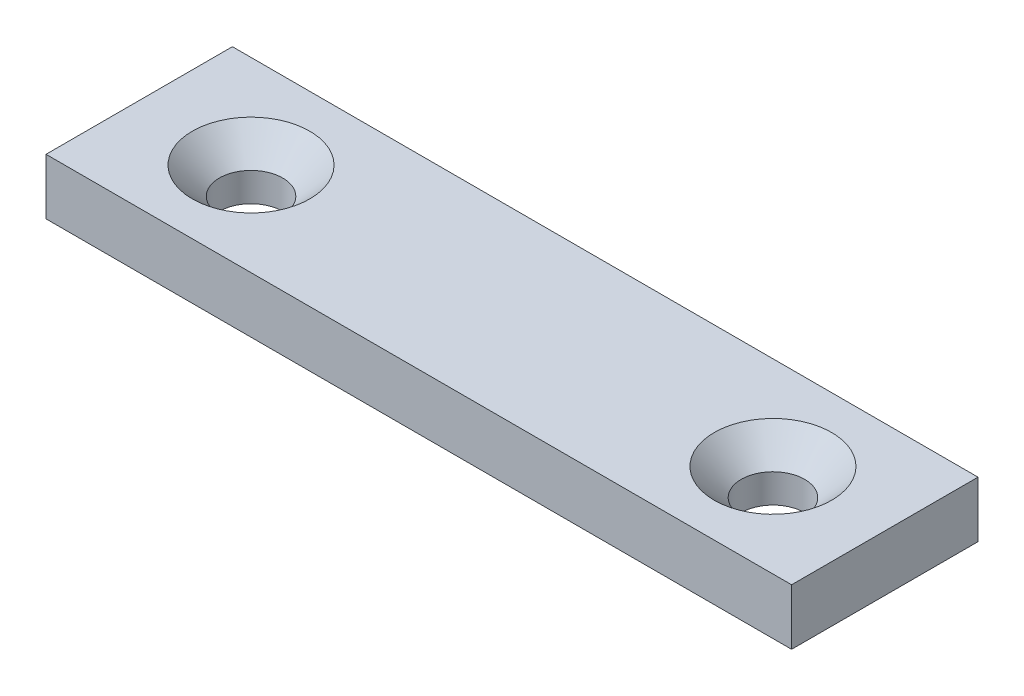
ISO-10303-21;
HEADER;
FILE_DESCRIPTION(('STEP AP214'),'2;1');
FILE_NAME('part.step','',(''),(''),'','','');
FILE_SCHEMA(('AUTOMOTIVE_DESIGN { 1 0 10303 214 1 1 1 1 }'));
ENDSEC;
DATA;
#1=APPLICATION_CONTEXT('core data for automotive mechanical design processes');
#2=APPLICATION_PROTOCOL_DEFINITION('international standard','automotive_design',2000,#1);
#3=PRODUCT_CONTEXT('',#1,'mechanical');
#4=PRODUCT('Part','Part','',(#3));
#5=PRODUCT_RELATED_PRODUCT_CATEGORY('part','',(#4));
#6=PRODUCT_DEFINITION_FORMATION('','',#4);
#7=PRODUCT_DEFINITION_CONTEXT('part definition',#1,'design');
#8=PRODUCT_DEFINITION('design','',#6,#7);
#9=PRODUCT_DEFINITION_SHAPE('','',#8);
#10=(LENGTH_UNIT() NAMED_UNIT(*) SI_UNIT(.MILLI.,.METRE.));
#11=(NAMED_UNIT(*) PLANE_ANGLE_UNIT() SI_UNIT($,.RADIAN.));
#12=(NAMED_UNIT(*) SI_UNIT($,.STERADIAN.) SOLID_ANGLE_UNIT());
#13=UNCERTAINTY_MEASURE_WITH_UNIT(LENGTH_MEASURE(1.E-05),#10,'distance_accuracy_value','');
#14=(GEOMETRIC_REPRESENTATION_CONTEXT(3) GLOBAL_UNCERTAINTY_ASSIGNED_CONTEXT((#13)) GLOBAL_UNIT_ASSIGNED_CONTEXT((#10,
#11,#12)) REPRESENTATION_CONTEXT('',''));
#15=CARTESIAN_POINT('',(0.,0.,0.));
#16=DIRECTION('',(0.,0.,1.));
#17=DIRECTION('',(1.,0.,0.));
#18=AXIS2_PLACEMENT_3D('',#15,#16,#17);
#19=CARTESIAN_POINT('',(20.,3.,5.));
#20=DIRECTION('',(-1.,0.,0.));
#21=DIRECTION('',(0.,0.,1.));
#22=AXIS2_PLACEMENT_3D('',#19,#20,#21);
#23=PLANE('',#22);
#24=DIRECTION('',(0.,0.,-1.));
#25=VECTOR('',#24,1.);
#26=CARTESIAN_POINT('',(20.,0.,5.));
#27=LINE('',#26,#25);
#28=CARTESIAN_POINT('',(20.,0.,5.));
#29=VERTEX_POINT('',#28);
#30=CARTESIAN_POINT('',(20.,0.,-5.));
#31=VERTEX_POINT('',#30);
#32=EDGE_CURVE('E97',#29,#31,#27,.T.);
#33=ORIENTED_EDGE('',*,*,#32,.T.);
#34=DIRECTION('',(0.,-1.,0.));
#35=VECTOR('',#34,1.);
#36=CARTESIAN_POINT('',(20.,3.,-5.));
#37=LINE('',#36,#35);
#38=CARTESIAN_POINT('',(20.,3.,-5.));
#39=VERTEX_POINT('',#38);
#40=EDGE_CURVE('E11',#39,#31,#37,.T.);
#41=ORIENTED_EDGE('',*,*,#40,.F.);
#42=DIRECTION('',(0.,0.,-1.));
#43=VECTOR('',#42,1.);
#44=CARTESIAN_POINT('',(20.,3.,5.));
#45=LINE('',#44,#43);
#46=CARTESIAN_POINT('',(20.,3.,5.));
#47=VERTEX_POINT('',#46);
#48=EDGE_CURVE('E85',#47,#39,#45,.T.);
#49=ORIENTED_EDGE('',*,*,#48,.F.);
#50=DIRECTION('',(0.,-1.,0.));
#51=VECTOR('',#50,1.);
#52=CARTESIAN_POINT('',(20.,3.,5.));
#53=LINE('',#52,#51);
#54=EDGE_CURVE('E93',#47,#29,#53,.T.);
#55=ORIENTED_EDGE('',*,*,#54,.T.);
#56=EDGE_LOOP('',(#33,#41,#49,#55));
#57=FACE_BOUND('',#56,.T.);
#58=ADVANCED_FACE('F34',(#57),#23,.F.);
#59=CARTESIAN_POINT('',(-20.,3.,-5.));
#60=DIRECTION('',(0.,0.,1.));
#61=DIRECTION('',(1.,0.,0.));
#62=AXIS2_PLACEMENT_3D('',#59,#60,#61);
#63=PLANE('',#62);
#64=DIRECTION('',(-1.,0.,0.));
#65=VECTOR('',#64,1.);
#66=CARTESIAN_POINT('',(-20.,0.,-5.));
#67=LINE('',#66,#65);
#68=CARTESIAN_POINT('',(-20.,0.,-5.));
#69=VERTEX_POINT('',#68);
#70=EDGE_CURVE('E89',#31,#69,#67,.T.);
#71=ORIENTED_EDGE('',*,*,#70,.T.);
#72=DIRECTION('',(0.,-1.,0.));
#73=VECTOR('',#72,1.);
#74=CARTESIAN_POINT('',(-20.,3.,-5.));
#75=LINE('',#74,#73);
#76=CARTESIAN_POINT('',(-20.,3.,-5.));
#77=VERTEX_POINT('',#76);
#78=EDGE_CURVE('E42',#77,#69,#75,.T.);
#79=ORIENTED_EDGE('',*,*,#78,.F.);
#80=DIRECTION('',(-1.,0.,0.));
#81=VECTOR('',#80,1.);
#82=CARTESIAN_POINT('',(-20.,3.,-5.));
#83=LINE('',#82,#81);
#84=EDGE_CURVE('E80',#39,#77,#83,.T.);
#85=ORIENTED_EDGE('',*,*,#84,.F.);
#86=ORIENTED_EDGE('',*,*,#40,.T.);
#87=EDGE_LOOP('',(#71,#79,#85,#86));
#88=FACE_BOUND('',#87,.T.);
#89=ADVANCED_FACE('F88',(#88),#63,.F.);
#90=CARTESIAN_POINT('',(-20.,3.,5.));
#91=DIRECTION('',(1.,0.,0.));
#92=DIRECTION('',(0.,0.,-1.));
#93=AXIS2_PLACEMENT_3D('',#90,#91,#92);
#94=PLANE('',#93);
#95=DIRECTION('',(0.,0.,1.));
#96=VECTOR('',#95,1.);
#97=CARTESIAN_POINT('',(-20.,0.,5.));
#98=LINE('',#97,#96);
#99=CARTESIAN_POINT('',(-20.,0.,5.));
#100=VERTEX_POINT('',#99);
#101=EDGE_CURVE('E67',#69,#100,#98,.T.);
#102=ORIENTED_EDGE('',*,*,#101,.T.);
#103=DIRECTION('',(0.,-1.,0.));
#104=VECTOR('',#103,1.);
#105=CARTESIAN_POINT('',(-20.,3.,5.));
#106=LINE('',#105,#104);
#107=CARTESIAN_POINT('',(-20.,3.,5.));
#108=VERTEX_POINT('',#107);
#109=EDGE_CURVE('E90',#108,#100,#106,.T.);
#110=ORIENTED_EDGE('',*,*,#109,.F.);
#111=DIRECTION('',(0.,0.,1.));
#112=VECTOR('',#111,1.);
#113=CARTESIAN_POINT('',(-20.,3.,5.));
#114=LINE('',#113,#112);
#115=EDGE_CURVE('E83',#77,#108,#114,.T.);
#116=ORIENTED_EDGE('',*,*,#115,.F.);
#117=ORIENTED_EDGE('',*,*,#78,.T.);
#118=EDGE_LOOP('',(#102,#110,#116,#117));
#119=FACE_BOUND('',#118,.T.);
#120=ADVANCED_FACE('F91',(#119),#94,.F.);
#121=CARTESIAN_POINT('',(-20.,3.,5.));
#122=DIRECTION('',(0.,0.,-1.));
#123=DIRECTION('',(-1.,0.,0.));
#124=AXIS2_PLACEMENT_3D('',#121,#122,#123);
#125=PLANE('',#124);
#126=DIRECTION('',(1.,0.,0.));
#127=VECTOR('',#126,1.);
#128=CARTESIAN_POINT('',(-20.,0.,5.));
#129=LINE('',#128,#127);
#130=EDGE_CURVE('E73',#100,#29,#129,.T.);
#131=ORIENTED_EDGE('',*,*,#130,.T.);
#132=ORIENTED_EDGE('',*,*,#54,.F.);
#133=DIRECTION('',(1.,0.,0.));
#134=VECTOR('',#133,1.);
#135=CARTESIAN_POINT('',(-20.,3.,5.));
#136=LINE('',#135,#134);
#137=EDGE_CURVE('E50',#108,#47,#136,.T.);
#138=ORIENTED_EDGE('',*,*,#137,.F.);
#139=ORIENTED_EDGE('',*,*,#109,.T.);
#140=EDGE_LOOP('',(#131,#132,#138,#139));
#141=FACE_BOUND('',#140,.T.);
#142=ADVANCED_FACE('F105',(#141),#125,.F.);
#143=CARTESIAN_POINT('',(0.,3.,0.));
#144=DIRECTION('',(0.,-1.,0.));
#145=DIRECTION('',(0.,0.,-1.));
#146=AXIS2_PLACEMENT_3D('',#143,#144,#145);
#147=PLANE('',#146);
#148=CARTESIAN_POINT('',(-14.,3.,0.));
#149=DIRECTION('',(0.,1.,0.));
#150=DIRECTION('',(0.,0.,1.));
#151=AXIS2_PLACEMENT_3D('',#148,#149,#150);
#152=CIRCLE('',#151,3.15);
#153=CARTESIAN_POINT('',(-14.,3.,3.15));
#154=VERTEX_POINT('',#153);
#155=EDGE_CURVE('E125',#154,#154,#152,.T.);
#156=ORIENTED_EDGE('',*,*,#155,.F.);
#157=EDGE_LOOP('',(#156));
#158=FACE_BOUND('',#157,.T.);
#159=CARTESIAN_POINT('',(14.,3.,0.));
#160=DIRECTION('',(0.,1.,0.));
#161=DIRECTION('',(0.,0.,1.));
#162=AXIS2_PLACEMENT_3D('',#159,#160,#161);
#163=CIRCLE('',#162,3.15);
#164=CARTESIAN_POINT('',(14.,3.,3.14999999999999));
#165=VERTEX_POINT('',#164);
#166=EDGE_CURVE('E116',#165,#165,#163,.T.);
#167=ORIENTED_EDGE('',*,*,#166,.F.);
#168=EDGE_LOOP('',(#167));
#169=FACE_BOUND('',#168,.T.);
#170=ORIENTED_EDGE('',*,*,#48,.T.);
#171=ORIENTED_EDGE('',*,*,#84,.T.);
#172=ORIENTED_EDGE('',*,*,#115,.T.);
#173=ORIENTED_EDGE('',*,*,#137,.T.);
#174=EDGE_LOOP('',(#170,#171,#172,#173));
#175=FACE_BOUND('',#174,.T.);
#176=ADVANCED_FACE('F81',(#158,#169,#175),#147,.F.);
#177=CARTESIAN_POINT('',(0.,0.,0.));
#178=DIRECTION('',(0.,-1.,0.));
#179=DIRECTION('',(0.,0.,-1.));
#180=AXIS2_PLACEMENT_3D('',#177,#178,#179);
#181=PLANE('',#180);
#182=CARTESIAN_POINT('',(-14.,0.,0.));
#183=DIRECTION('',(0.,1.,0.));
#184=DIRECTION('',(0.,0.,1.));
#185=AXIS2_PLACEMENT_3D('',#182,#183,#184);
#186=CIRCLE('',#185,1.7);
#187=CARTESIAN_POINT('',(-14.,0.,1.7));
#188=VERTEX_POINT('',#187);
#189=EDGE_CURVE('E119',#188,#188,#186,.T.);
#190=ORIENTED_EDGE('',*,*,#189,.T.);
#191=EDGE_LOOP('',(#190));
#192=FACE_BOUND('',#191,.T.);
#193=CARTESIAN_POINT('',(14.,0.,0.));
#194=DIRECTION('',(0.,1.,0.));
#195=DIRECTION('',(0.,0.,1.));
#196=AXIS2_PLACEMENT_3D('',#193,#194,#195);
#197=CIRCLE('',#196,1.7);
#198=CARTESIAN_POINT('',(14.,0.,1.69999999999999));
#199=VERTEX_POINT('',#198);
#200=EDGE_CURVE('E100',#199,#199,#197,.T.);
#201=ORIENTED_EDGE('',*,*,#200,.T.);
#202=EDGE_LOOP('',(#201));
#203=FACE_BOUND('',#202,.T.);
#204=ORIENTED_EDGE('',*,*,#32,.F.);
#205=ORIENTED_EDGE('',*,*,#130,.F.);
#206=ORIENTED_EDGE('',*,*,#101,.F.);
#207=ORIENTED_EDGE('',*,*,#70,.F.);
#208=EDGE_LOOP('',(#204,#205,#206,#207));
#209=FACE_BOUND('',#208,.T.);
#210=ADVANCED_FACE('F108',(#192,#203,#209),#181,.T.);
#211=CARTESIAN_POINT('',(14.,3.,0.));
#212=DIRECTION('',(0.,1.,0.));
#213=DIRECTION('',(0.,0.,1.));
#214=AXIS2_PLACEMENT_3D('',#211,#212,#213);
#215=CYLINDRICAL_SURFACE('',#214,1.7);
#216=ORIENTED_EDGE('',*,*,#200,.F.);
#217=EDGE_LOOP('',(#216));
#218=FACE_BOUND('',#217,.T.);
#219=CARTESIAN_POINT('',(14.,1.55,0.));
#220=DIRECTION('',(0.,1.,0.));
#221=DIRECTION('',(0.,0.,1.));
#222=AXIS2_PLACEMENT_3D('',#219,#220,#221);
#223=CIRCLE('',#222,1.7);
#224=CARTESIAN_POINT('',(14.,1.55,1.69999999999999));
#225=VERTEX_POINT('',#224);
#226=EDGE_CURVE('E113',#225,#225,#223,.T.);
#227=ORIENTED_EDGE('',*,*,#226,.T.);
#228=EDGE_LOOP('',(#227));
#229=FACE_BOUND('',#228,.T.);
#230=ADVANCED_FACE('F139',(#218,#229),#215,.F.);
#231=CARTESIAN_POINT('',(14.,3.,0.));
#232=DIRECTION('',(0.,1.,0.));
#233=DIRECTION('',(0.,0.,1.));
#234=AXIS2_PLACEMENT_3D('',#231,#232,#233);
#235=CONICAL_SURFACE('',#234,3.15,0.785398163397447);
#236=ORIENTED_EDGE('',*,*,#226,.F.);
#237=EDGE_LOOP('',(#236));
#238=FACE_BOUND('',#237,.T.);
#239=ORIENTED_EDGE('',*,*,#166,.T.);
#240=EDGE_LOOP('',(#239));
#241=FACE_BOUND('',#240,.T.);
#242=ADVANCED_FACE('F136',(#238,#241),#235,.F.);
#243=CARTESIAN_POINT('',(-14.,3.,0.));
#244=DIRECTION('',(0.,1.,0.));
#245=DIRECTION('',(0.,0.,1.));
#246=AXIS2_PLACEMENT_3D('',#243,#244,#245);
#247=CYLINDRICAL_SURFACE('',#246,1.7);
#248=ORIENTED_EDGE('',*,*,#189,.F.);
#249=EDGE_LOOP('',(#248));
#250=FACE_BOUND('',#249,.T.);
#251=CARTESIAN_POINT('',(-14.,1.55,0.));
#252=DIRECTION('',(0.,1.,0.));
#253=DIRECTION('',(0.,0.,1.));
#254=AXIS2_PLACEMENT_3D('',#251,#252,#253);
#255=CIRCLE('',#254,1.7);
#256=CARTESIAN_POINT('',(-14.,1.55,1.7));
#257=VERTEX_POINT('',#256);
#258=EDGE_CURVE('E122',#257,#257,#255,.T.);
#259=ORIENTED_EDGE('',*,*,#258,.T.);
#260=EDGE_LOOP('',(#259));
#261=FACE_BOUND('',#260,.T.);
#262=ADVANCED_FACE('F138',(#250,#261),#247,.F.);
#263=CARTESIAN_POINT('',(-14.,3.,0.));
#264=DIRECTION('',(0.,1.,0.));
#265=DIRECTION('',(0.,0.,1.));
#266=AXIS2_PLACEMENT_3D('',#263,#264,#265);
#267=CONICAL_SURFACE('',#266,3.15,0.785398163397448);
#268=ORIENTED_EDGE('',*,*,#258,.F.);
#269=EDGE_LOOP('',(#268));
#270=FACE_BOUND('',#269,.T.);
#271=ORIENTED_EDGE('',*,*,#155,.T.);
#272=EDGE_LOOP('',(#271));
#273=FACE_BOUND('',#272,.T.);
#274=ADVANCED_FACE('F129',(#270,#273),#267,.F.);
#275=CLOSED_SHELL('',(#58,#89,#120,#142,#176,#210,#230,#242,#262,#274));
#276=MANIFOLD_SOLID_BREP('B2',#275);
#277=ADVANCED_BREP_SHAPE_REPRESENTATION('',(#18,#276),#14);
#278=SHAPE_DEFINITION_REPRESENTATION(#9,#277);
ENDSEC;
END-ISO-10303-21;
